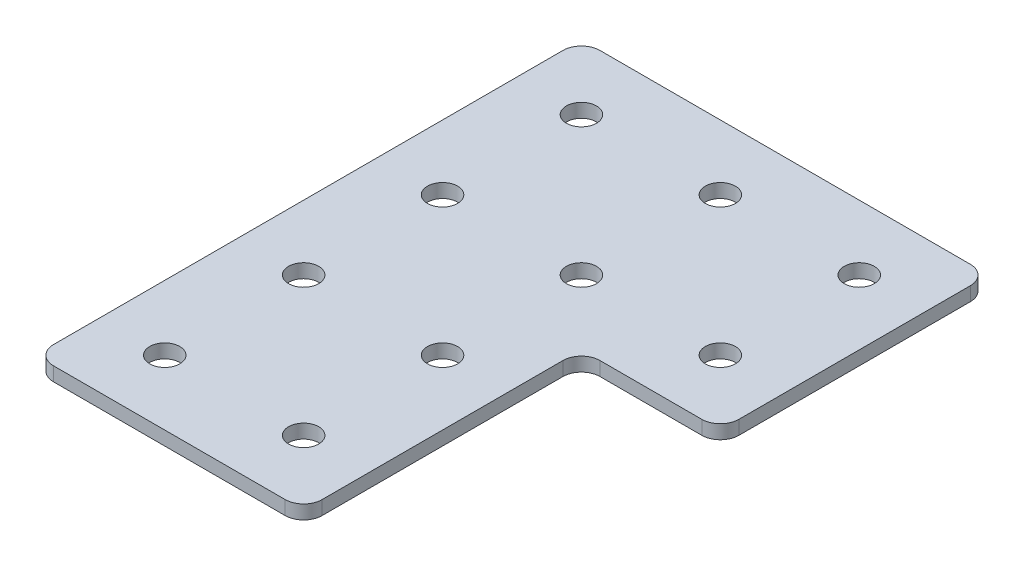
ISO-10303-21;
HEADER;
FILE_DESCRIPTION(('STEP AP214'),'2;1');
FILE_NAME('part.step','',(''),(''),'','','');
FILE_SCHEMA(('AUTOMOTIVE_DESIGN { 1 0 10303 214 1 1 1 1 }'));
ENDSEC;
DATA;
#1=APPLICATION_CONTEXT('core data for automotive mechanical design processes');
#2=APPLICATION_PROTOCOL_DEFINITION('international standard','automotive_design',2000,#1);
#3=PRODUCT_CONTEXT('',#1,'mechanical');
#4=PRODUCT('Part','Part','',(#3));
#5=PRODUCT_RELATED_PRODUCT_CATEGORY('part','',(#4));
#6=PRODUCT_DEFINITION_FORMATION('','',#4);
#7=PRODUCT_DEFINITION_CONTEXT('part definition',#1,'design');
#8=PRODUCT_DEFINITION('design','',#6,#7);
#9=PRODUCT_DEFINITION_SHAPE('','',#8);
#10=(LENGTH_UNIT() NAMED_UNIT(*) SI_UNIT(.MILLI.,.METRE.));
#11=(NAMED_UNIT(*) PLANE_ANGLE_UNIT() SI_UNIT($,.RADIAN.));
#12=(NAMED_UNIT(*) SI_UNIT($,.STERADIAN.) SOLID_ANGLE_UNIT());
#13=UNCERTAINTY_MEASURE_WITH_UNIT(LENGTH_MEASURE(1.E-05),#10,'distance_accuracy_value','');
#14=(GEOMETRIC_REPRESENTATION_CONTEXT(3) GLOBAL_UNCERTAINTY_ASSIGNED_CONTEXT((#13)) GLOBAL_UNIT_ASSIGNED_CONTEXT((#10,
#11,#12)) REPRESENTATION_CONTEXT('',''));
#15=CARTESIAN_POINT('',(0.,0.,0.));
#16=DIRECTION('',(0.,0.,1.));
#17=DIRECTION('',(1.,0.,0.));
#18=AXIS2_PLACEMENT_3D('',#15,#16,#17);
#19=CARTESIAN_POINT('',(-8.84521083117534,1.74134831028641,-16.1457325979904));
#20=DIRECTION('',(0.,-1.,0.));
#21=DIRECTION('',(0.,0.,-1.));
#22=AXIS2_PLACEMENT_3D('',#19,#20,#21);
#23=PLANE('',#22);
#24=CARTESIAN_POINT('',(13.6547891688246,1.74134831028641,-8.64573259799039));
#25=DIRECTION('',(0.,1.,0.));
#26=DIRECTION('',(0.,0.,1.));
#27=AXIS2_PLACEMENT_3D('',#24,#25,#26);
#28=CIRCLE('',#27,1.625);
#29=CARTESIAN_POINT('',(13.6547891688246,1.74134831028641,-7.02073259799039));
#30=VERTEX_POINT('',#29);
#31=EDGE_CURVE('E278',#30,#30,#28,.T.);
#32=ORIENTED_EDGE('',*,*,#31,.T.);
#33=EDGE_LOOP('',(#32));
#34=FACE_BOUND('',#33,.T.);
#35=CARTESIAN_POINT('',(-1.34521083117534,1.74134831028641,21.3542674020096));
#36=DIRECTION('',(0.,1.,0.));
#37=DIRECTION('',(0.,0.,1.));
#38=AXIS2_PLACEMENT_3D('',#35,#36,#37);
#39=CIRCLE('',#38,1.625);
#40=CARTESIAN_POINT('',(-1.34521083117534,1.74134831028641,22.9792674020096));
#41=VERTEX_POINT('',#40);
#42=EDGE_CURVE('E272',#41,#41,#39,.T.);
#43=ORIENTED_EDGE('',*,*,#42,.T.);
#44=EDGE_LOOP('',(#43));
#45=FACE_BOUND('',#44,.T.);
#46=CARTESIAN_POINT('',(-16.3452108311754,1.74134831028641,21.3542674020096));
#47=DIRECTION('',(0.,1.,0.));
#48=DIRECTION('',(0.,0.,1.));
#49=AXIS2_PLACEMENT_3D('',#46,#47,#48);
#50=CIRCLE('',#49,1.625);
#51=CARTESIAN_POINT('',(-16.3452108311754,1.74134831028641,22.9792674020096));
#52=VERTEX_POINT('',#51);
#53=EDGE_CURVE('E266',#52,#52,#50,.T.);
#54=ORIENTED_EDGE('',*,*,#53,.T.);
#55=EDGE_LOOP('',(#54));
#56=FACE_BOUND('',#55,.T.);
#57=CARTESIAN_POINT('',(-1.34521083117533,1.74134831028641,6.35426740200959));
#58=DIRECTION('',(0.,1.,0.));
#59=DIRECTION('',(0.,0.,1.));
#60=AXIS2_PLACEMENT_3D('',#57,#58,#59);
#61=CIRCLE('',#60,1.625);
#62=CARTESIAN_POINT('',(-1.34521083117533,1.74134831028641,7.97926740200959));
#63=VERTEX_POINT('',#62);
#64=EDGE_CURVE('E260',#63,#63,#61,.T.);
#65=ORIENTED_EDGE('',*,*,#64,.T.);
#66=EDGE_LOOP('',(#65));
#67=FACE_BOUND('',#66,.T.);
#68=CARTESIAN_POINT('',(-16.3452108311754,1.74134831028641,6.35426740200959));
#69=DIRECTION('',(0.,1.,0.));
#70=DIRECTION('',(0.,0.,1.));
#71=AXIS2_PLACEMENT_3D('',#68,#69,#70);
#72=CIRCLE('',#71,1.625);
#73=CARTESIAN_POINT('',(-16.3452108311754,1.74134831028641,7.97926740200959));
#74=VERTEX_POINT('',#73);
#75=EDGE_CURVE('E254',#74,#74,#72,.T.);
#76=ORIENTED_EDGE('',*,*,#75,.T.);
#77=EDGE_LOOP('',(#76));
#78=FACE_BOUND('',#77,.T.);
#79=CARTESIAN_POINT('',(-1.34521083117536,1.74134831028641,-8.6457325979904));
#80=DIRECTION('',(0.,1.,0.));
#81=DIRECTION('',(0.,0.,1.));
#82=AXIS2_PLACEMENT_3D('',#79,#80,#81);
#83=CIRCLE('',#82,1.625);
#84=CARTESIAN_POINT('',(-1.34521083117536,1.74134831028641,-7.02073259799039));
#85=VERTEX_POINT('',#84);
#86=EDGE_CURVE('E248',#85,#85,#83,.T.);
#87=ORIENTED_EDGE('',*,*,#86,.T.);
#88=EDGE_LOOP('',(#87));
#89=FACE_BOUND('',#88,.T.);
#90=CARTESIAN_POINT('',(-16.3452108311754,1.74134831028641,-8.64573259799041));
#91=DIRECTION('',(0.,1.,0.));
#92=DIRECTION('',(0.,0.,1.));
#93=AXIS2_PLACEMENT_3D('',#90,#91,#92);
#94=CIRCLE('',#93,1.625);
#95=CARTESIAN_POINT('',(-16.3452108311754,1.74134831028641,-7.02073259799041));
#96=VERTEX_POINT('',#95);
#97=EDGE_CURVE('E242',#96,#96,#94,.T.);
#98=ORIENTED_EDGE('',*,*,#97,.T.);
#99=EDGE_LOOP('',(#98));
#100=FACE_BOUND('',#99,.T.);
#101=CARTESIAN_POINT('',(13.6547891688246,1.74134831028641,-23.6457325979904));
#102=DIRECTION('',(0.,1.,0.));
#103=DIRECTION('',(0.,0.,1.));
#104=AXIS2_PLACEMENT_3D('',#101,#102,#103);
#105=CIRCLE('',#104,1.625);
#106=CARTESIAN_POINT('',(13.6547891688246,1.74134831028641,-22.0207325979904));
#107=VERTEX_POINT('',#106);
#108=EDGE_CURVE('E236',#107,#107,#105,.T.);
#109=ORIENTED_EDGE('',*,*,#108,.T.);
#110=EDGE_LOOP('',(#109));
#111=FACE_BOUND('',#110,.T.);
#112=CARTESIAN_POINT('',(-1.34521083117536,1.74134831028641,-23.6457325979904));
#113=DIRECTION('',(0.,1.,0.));
#114=DIRECTION('',(0.,0.,1.));
#115=AXIS2_PLACEMENT_3D('',#112,#113,#114);
#116=CIRCLE('',#115,1.625);
#117=CARTESIAN_POINT('',(-1.34521083117536,1.74134831028641,-22.0207325979904));
#118=VERTEX_POINT('',#117);
#119=EDGE_CURVE('E230',#118,#118,#116,.T.);
#120=ORIENTED_EDGE('',*,*,#119,.T.);
#121=EDGE_LOOP('',(#120));
#122=FACE_BOUND('',#121,.T.);
#123=CARTESIAN_POINT('',(-16.3452108311754,1.74134831028641,-23.6457325979904));
#124=DIRECTION('',(0.,1.,0.));
#125=DIRECTION('',(0.,0.,1.));
#126=AXIS2_PLACEMENT_3D('',#123,#124,#125);
#127=CIRCLE('',#126,1.625);
#128=CARTESIAN_POINT('',(-16.3452108311754,1.74134831028641,-22.0207325979904));
#129=VERTEX_POINT('',#128);
#130=EDGE_CURVE('E204',#129,#129,#127,.T.);
#131=ORIENTED_EDGE('',*,*,#130,.T.);
#132=EDGE_LOOP('',(#131));
#133=FACE_BOUND('',#132,.T.);
#134=DIRECTION('',(0.,0.,1.));
#135=VECTOR('',#134,1.);
#136=CARTESIAN_POINT('',(-23.3452108311753,1.74134831028641,-30.6457325979904));
#137=LINE('',#136,#135);
#138=CARTESIAN_POINT('',(-23.3452108311753,1.74134831028641,-28.6457325979904));
#139=VERTEX_POINT('',#138);
#140=CARTESIAN_POINT('',(-23.3452108311753,1.74134831028641,26.3542674020096));
#141=VERTEX_POINT('',#140);
#142=EDGE_CURVE('E200',#139,#141,#137,.T.);
#143=ORIENTED_EDGE('',*,*,#142,.F.);
#144=CARTESIAN_POINT('',(-21.3452108311753,1.74134831028641,-28.6457325979904));
#145=DIRECTION('',(0.,-1.,0.));
#146=DIRECTION('',(0.,0.,-1.));
#147=AXIS2_PLACEMENT_3D('',#144,#145,#146);
#148=CIRCLE('',#147,2.);
#149=CARTESIAN_POINT('',(-21.3452108311753,1.74134831028641,-30.6457325979904));
#150=VERTEX_POINT('',#149);
#151=EDGE_CURVE('E159',#139,#150,#148,.T.);
#152=ORIENTED_EDGE('',*,*,#151,.T.);
#153=DIRECTION('',(-1.,0.,0.));
#154=VECTOR('',#153,1.);
#155=CARTESIAN_POINT('',(20.6547891688247,1.74134831028641,-30.6457325979904));
#156=LINE('',#155,#154);
#157=CARTESIAN_POINT('',(18.6547891688247,1.74134831028641,-30.6457325979904));
#158=VERTEX_POINT('',#157);
#159=EDGE_CURVE('E222',#158,#150,#156,.T.);
#160=ORIENTED_EDGE('',*,*,#159,.F.);
#161=CARTESIAN_POINT('',(18.6547891688247,1.74134831028641,-28.6457325979904));
#162=DIRECTION('',(0.,-1.,0.));
#163=DIRECTION('',(0.,0.,-1.));
#164=AXIS2_PLACEMENT_3D('',#161,#162,#163);
#165=CIRCLE('',#164,2.);
#166=CARTESIAN_POINT('',(20.6547891688247,1.74134831028641,-28.6457325979904));
#167=VERTEX_POINT('',#166);
#168=EDGE_CURVE('E131',#158,#167,#165,.T.);
#169=ORIENTED_EDGE('',*,*,#168,.T.);
#170=DIRECTION('',(0.,0.,-1.));
#171=VECTOR('',#170,1.);
#172=CARTESIAN_POINT('',(20.6547891688247,1.74134831028641,-1.64573259799037));
#173=LINE('',#172,#171);
#174=CARTESIAN_POINT('',(20.6547891688247,1.74134831028641,-3.64573259799037));
#175=VERTEX_POINT('',#174);
#176=EDGE_CURVE('E190',#175,#167,#173,.T.);
#177=ORIENTED_EDGE('',*,*,#176,.F.);
#178=CARTESIAN_POINT('',(18.6547891688247,1.74134831028641,-3.64573259799037));
#179=DIRECTION('',(0.,-1.,0.));
#180=DIRECTION('',(0.,0.,-1.));
#181=AXIS2_PLACEMENT_3D('',#178,#179,#180);
#182=CIRCLE('',#181,2.);
#183=CARTESIAN_POINT('',(18.6547891688247,1.74134831028641,-1.64573259799037));
#184=VERTEX_POINT('',#183);
#185=EDGE_CURVE('E155',#175,#184,#182,.T.);
#186=ORIENTED_EDGE('',*,*,#185,.T.);
#187=DIRECTION('',(1.,0.,0.));
#188=VECTOR('',#187,1.);
#189=CARTESIAN_POINT('',(5.65478916882466,1.74134831028641,-1.64573259799037));
#190=LINE('',#189,#188);
#191=CARTESIAN_POINT('',(7.65478916882466,1.74134831028641,-1.64573259799037));
#192=VERTEX_POINT('',#191);
#193=EDGE_CURVE('E132',#192,#184,#190,.T.);
#194=ORIENTED_EDGE('',*,*,#193,.F.);
#195=CARTESIAN_POINT('',(7.65478916882466,1.74134831028641,0.354267402009629));
#196=DIRECTION('',(0.,-1.,0.));
#197=DIRECTION('',(0.,0.,-1.));
#198=AXIS2_PLACEMENT_3D('',#195,#196,#197);
#199=CIRCLE('',#198,2.);
#200=CARTESIAN_POINT('',(5.65478916882466,1.74134831028641,0.354267402009629));
#201=VERTEX_POINT('',#200);
#202=EDGE_CURVE('E10',#192,#201,#199,.F.);
#203=ORIENTED_EDGE('',*,*,#202,.T.);
#204=DIRECTION('',(0.,0.,-1.));
#205=VECTOR('',#204,1.);
#206=CARTESIAN_POINT('',(5.65478916882466,1.74134831028641,28.3542674020096));
#207=LINE('',#206,#205);
#208=CARTESIAN_POINT('',(5.65478916882466,1.74134831028641,26.3542674020096));
#209=VERTEX_POINT('',#208);
#210=EDGE_CURVE('E136',#209,#201,#207,.T.);
#211=ORIENTED_EDGE('',*,*,#210,.F.);
#212=CARTESIAN_POINT('',(3.65478916882466,1.74134831028641,26.3542674020096));
#213=DIRECTION('',(0.,-1.,0.));
#214=DIRECTION('',(0.,0.,-1.));
#215=AXIS2_PLACEMENT_3D('',#212,#213,#214);
#216=CIRCLE('',#215,2.);
#217=CARTESIAN_POINT('',(3.65478916882466,1.74134831028641,28.3542674020096));
#218=VERTEX_POINT('',#217);
#219=EDGE_CURVE('E31',#209,#218,#216,.T.);
#220=ORIENTED_EDGE('',*,*,#219,.T.);
#221=DIRECTION('',(1.,0.,0.));
#222=VECTOR('',#221,1.);
#223=CARTESIAN_POINT('',(-23.3452108311753,1.74134831028641,28.3542674020096));
#224=LINE('',#223,#222);
#225=CARTESIAN_POINT('',(-21.3452108311753,1.74134831028641,28.3542674020096));
#226=VERTEX_POINT('',#225);
#227=EDGE_CURVE('E198',#226,#218,#224,.T.);
#228=ORIENTED_EDGE('',*,*,#227,.F.);
#229=CARTESIAN_POINT('',(-21.3452108311753,1.74134831028641,26.3542674020096));
#230=DIRECTION('',(0.,-1.,0.));
#231=DIRECTION('',(0.,0.,-1.));
#232=AXIS2_PLACEMENT_3D('',#229,#230,#231);
#233=CIRCLE('',#232,2.);
#234=EDGE_CURVE('E157',#226,#141,#233,.T.);
#235=ORIENTED_EDGE('',*,*,#234,.T.);
#236=EDGE_LOOP('',(#143,#152,#160,#169,#177,#186,#194,#203,#211,#220,#228,#235));
#237=FACE_BOUND('',#236,.T.);
#238=ADVANCED_FACE('F16',(#34,#45,#56,#67,#78,#89,#100,#111,#122,#133,#237),#23,.T.);
#239=CARTESIAN_POINT('',(20.6547891688247,1.74134831028641,-1.64573259799037));
#240=DIRECTION('',(1.,0.,0.));
#241=DIRECTION('',(0.,0.,-1.));
#242=AXIS2_PLACEMENT_3D('',#239,#240,#241);
#243=PLANE('',#242);
#244=DIRECTION('',(0.,0.,-1.));
#245=VECTOR('',#244,1.);
#246=CARTESIAN_POINT('',(20.6547891688247,3.24134831028641,-1.64573259799037));
#247=LINE('',#246,#245);
#248=CARTESIAN_POINT('',(20.6547891688247,3.24134831028641,-3.64573259799037));
#249=VERTEX_POINT('',#248);
#250=CARTESIAN_POINT('',(20.6547891688247,3.24134831028641,-28.6457325979904));
#251=VERTEX_POINT('',#250);
#252=EDGE_CURVE('E111',#249,#251,#247,.T.);
#253=ORIENTED_EDGE('',*,*,#252,.F.);
#254=DIRECTION('',(0.,1.,0.));
#255=VECTOR('',#254,1.);
#256=CARTESIAN_POINT('',(20.6547891688247,1.74134831028641,-3.64573259799037));
#257=LINE('',#256,#255);
#258=EDGE_CURVE('E177',#249,#175,#257,.F.);
#259=ORIENTED_EDGE('',*,*,#258,.T.);
#260=ORIENTED_EDGE('',*,*,#176,.T.);
#261=DIRECTION('',(0.,1.,0.));
#262=VECTOR('',#261,1.);
#263=CARTESIAN_POINT('',(20.6547891688247,1.74134831028641,-28.6457325979904));
#264=LINE('',#263,#262);
#265=EDGE_CURVE('E175',#167,#251,#264,.T.);
#266=ORIENTED_EDGE('',*,*,#265,.T.);
#267=EDGE_LOOP('',(#253,#259,#260,#266));
#268=FACE_BOUND('',#267,.T.);
#269=ADVANCED_FACE('F333',(#268),#243,.T.);
#270=CARTESIAN_POINT('',(5.65478916882466,1.74134831028641,-1.64573259799037));
#271=DIRECTION('',(0.,0.,1.));
#272=DIRECTION('',(1.,0.,0.));
#273=AXIS2_PLACEMENT_3D('',#270,#271,#272);
#274=PLANE('',#273);
#275=DIRECTION('',(1.,0.,0.));
#276=VECTOR('',#275,1.);
#277=CARTESIAN_POINT('',(5.65478916882466,3.24134831028641,-1.64573259799037));
#278=LINE('',#277,#276);
#279=CARTESIAN_POINT('',(7.65478916882466,3.24134831028641,-1.64573259799037));
#280=VERTEX_POINT('',#279);
#281=CARTESIAN_POINT('',(18.6547891688247,3.24134831028641,-1.64573259799037));
#282=VERTEX_POINT('',#281);
#283=EDGE_CURVE('E139',#280,#282,#278,.T.);
#284=ORIENTED_EDGE('',*,*,#283,.F.);
#285=DIRECTION('',(0.,1.,0.));
#286=VECTOR('',#285,1.);
#287=CARTESIAN_POINT('',(7.65478916882466,1.74134831028641,-1.64573259799037));
#288=LINE('',#287,#286);
#289=EDGE_CURVE('E173',#280,#192,#288,.F.);
#290=ORIENTED_EDGE('',*,*,#289,.T.);
#291=ORIENTED_EDGE('',*,*,#193,.T.);
#292=DIRECTION('',(0.,1.,0.));
#293=VECTOR('',#292,1.);
#294=CARTESIAN_POINT('',(18.6547891688247,1.74134831028641,-1.64573259799037));
#295=LINE('',#294,#293);
#296=EDGE_CURVE('E170',#184,#282,#295,.T.);
#297=ORIENTED_EDGE('',*,*,#296,.T.);
#298=EDGE_LOOP('',(#284,#290,#291,#297));
#299=FACE_BOUND('',#298,.T.);
#300=ADVANCED_FACE('F187',(#299),#274,.T.);
#301=CARTESIAN_POINT('',(5.65478916882466,1.74134831028641,28.3542674020096));
#302=DIRECTION('',(1.,0.,0.));
#303=DIRECTION('',(0.,0.,-1.));
#304=AXIS2_PLACEMENT_3D('',#301,#302,#303);
#305=PLANE('',#304);
#306=ORIENTED_EDGE('',*,*,#210,.T.);
#307=DIRECTION('',(0.,1.,0.));
#308=VECTOR('',#307,1.);
#309=CARTESIAN_POINT('',(5.65478916882466,3.24134831028641,0.354267402009629));
#310=LINE('',#309,#308);
#311=CARTESIAN_POINT('',(5.65478916882466,3.24134831028641,0.354267402009629));
#312=VERTEX_POINT('',#311);
#313=EDGE_CURVE('E167',#201,#312,#310,.T.);
#314=ORIENTED_EDGE('',*,*,#313,.T.);
#315=DIRECTION('',(0.,0.,-1.));
#316=VECTOR('',#315,1.);
#317=CARTESIAN_POINT('',(5.65478916882466,3.24134831028641,28.3542674020096));
#318=LINE('',#317,#316);
#319=CARTESIAN_POINT('',(5.65478916882466,3.24134831028641,26.3542674020096));
#320=VERTEX_POINT('',#319);
#321=EDGE_CURVE('E182',#320,#312,#318,.T.);
#322=ORIENTED_EDGE('',*,*,#321,.F.);
#323=DIRECTION('',(0.,1.,0.));
#324=VECTOR('',#323,1.);
#325=CARTESIAN_POINT('',(5.65478916882466,1.74134831028641,26.3542674020096));
#326=LINE('',#325,#324);
#327=EDGE_CURVE('E165',#320,#209,#326,.F.);
#328=ORIENTED_EDGE('',*,*,#327,.T.);
#329=EDGE_LOOP('',(#306,#314,#322,#328));
#330=FACE_BOUND('',#329,.T.);
#331=ADVANCED_FACE('F196',(#330),#305,.T.);
#332=CARTESIAN_POINT('',(-23.3452108311753,1.74134831028641,28.3542674020096));
#333=DIRECTION('',(0.,0.,1.));
#334=DIRECTION('',(1.,0.,0.));
#335=AXIS2_PLACEMENT_3D('',#332,#333,#334);
#336=PLANE('',#335);
#337=DIRECTION('',(1.,0.,0.));
#338=VECTOR('',#337,1.);
#339=CARTESIAN_POINT('',(-23.3452108311753,3.24134831028641,28.3542674020096));
#340=LINE('',#339,#338);
#341=CARTESIAN_POINT('',(-21.3452108311753,3.24134831028641,28.3542674020096));
#342=VERTEX_POINT('',#341);
#343=CARTESIAN_POINT('',(3.65478916882466,3.24134831028641,28.3542674020096));
#344=VERTEX_POINT('',#343);
#345=EDGE_CURVE('E208',#342,#344,#340,.T.);
#346=ORIENTED_EDGE('',*,*,#345,.F.);
#347=DIRECTION('',(0.,1.,0.));
#348=VECTOR('',#347,1.);
#349=CARTESIAN_POINT('',(-21.3452108311753,1.74134831028641,28.3542674020096));
#350=LINE('',#349,#348);
#351=EDGE_CURVE('E38',#342,#226,#350,.F.);
#352=ORIENTED_EDGE('',*,*,#351,.T.);
#353=ORIENTED_EDGE('',*,*,#227,.T.);
#354=DIRECTION('',(0.,1.,0.));
#355=VECTOR('',#354,1.);
#356=CARTESIAN_POINT('',(3.65478916882466,1.74134831028641,28.3542674020096));
#357=LINE('',#356,#355);
#358=EDGE_CURVE('E161',#218,#344,#357,.T.);
#359=ORIENTED_EDGE('',*,*,#358,.T.);
#360=EDGE_LOOP('',(#346,#352,#353,#359));
#361=FACE_BOUND('',#360,.T.);
#362=ADVANCED_FACE('F210',(#361),#336,.T.);
#363=CARTESIAN_POINT('',(-23.3452108311753,1.74134831028641,-30.6457325979904));
#364=DIRECTION('',(-1.,0.,0.));
#365=DIRECTION('',(0.,0.,1.));
#366=AXIS2_PLACEMENT_3D('',#363,#364,#365);
#367=PLANE('',#366);
#368=DIRECTION('',(0.,0.,1.));
#369=VECTOR('',#368,1.);
#370=CARTESIAN_POINT('',(-23.3452108311753,3.24134831028641,-30.6457325979904));
#371=LINE('',#370,#369);
#372=CARTESIAN_POINT('',(-23.3452108311753,3.24134831028641,-28.6457325979904));
#373=VERTEX_POINT('',#372);
#374=CARTESIAN_POINT('',(-23.3452108311753,3.24134831028641,26.3542674020096));
#375=VERTEX_POINT('',#374);
#376=EDGE_CURVE('E127',#373,#375,#371,.T.);
#377=ORIENTED_EDGE('',*,*,#376,.F.);
#378=DIRECTION('',(0.,1.,0.));
#379=VECTOR('',#378,1.);
#380=CARTESIAN_POINT('',(-23.3452108311753,1.74134831028641,-28.6457325979904));
#381=LINE('',#380,#379);
#382=EDGE_CURVE('E151',#373,#139,#381,.F.);
#383=ORIENTED_EDGE('',*,*,#382,.T.);
#384=ORIENTED_EDGE('',*,*,#142,.T.);
#385=DIRECTION('',(0.,1.,0.));
#386=VECTOR('',#385,1.);
#387=CARTESIAN_POINT('',(-23.3452108311753,1.74134831028641,26.3542674020096));
#388=LINE('',#387,#386);
#389=EDGE_CURVE('E148',#141,#375,#388,.T.);
#390=ORIENTED_EDGE('',*,*,#389,.T.);
#391=EDGE_LOOP('',(#377,#383,#384,#390));
#392=FACE_BOUND('',#391,.T.);
#393=ADVANCED_FACE('F220',(#392),#367,.T.);
#394=CARTESIAN_POINT('',(20.6547891688247,1.74134831028641,-30.6457325979904));
#395=DIRECTION('',(0.,0.,-1.));
#396=DIRECTION('',(-1.,0.,0.));
#397=AXIS2_PLACEMENT_3D('',#394,#395,#396);
#398=PLANE('',#397);
#399=ORIENTED_EDGE('',*,*,#159,.T.);
#400=DIRECTION('',(0.,1.,0.));
#401=VECTOR('',#400,1.);
#402=CARTESIAN_POINT('',(-21.3452108311753,1.74134831028641,-30.6457325979904));
#403=LINE('',#402,#401);
#404=CARTESIAN_POINT('',(-21.3452108311753,3.24134831028641,-30.6457325979904));
#405=VERTEX_POINT('',#404);
#406=EDGE_CURVE('E126',#150,#405,#403,.T.);
#407=ORIENTED_EDGE('',*,*,#406,.T.);
#408=DIRECTION('',(-1.,0.,0.));
#409=VECTOR('',#408,1.);
#410=CARTESIAN_POINT('',(20.6547891688247,3.24134831028641,-30.6457325979904));
#411=LINE('',#410,#409);
#412=CARTESIAN_POINT('',(18.6547891688247,3.24134831028641,-30.6457325979904));
#413=VERTEX_POINT('',#412);
#414=EDGE_CURVE('E109',#413,#405,#411,.T.);
#415=ORIENTED_EDGE('',*,*,#414,.F.);
#416=DIRECTION('',(0.,1.,0.));
#417=VECTOR('',#416,1.);
#418=CARTESIAN_POINT('',(18.6547891688247,1.74134831028641,-30.6457325979904));
#419=LINE('',#418,#417);
#420=EDGE_CURVE('E123',#413,#158,#419,.F.);
#421=ORIENTED_EDGE('',*,*,#420,.T.);
#422=EDGE_LOOP('',(#399,#407,#415,#421));
#423=FACE_BOUND('',#422,.T.);
#424=ADVANCED_FACE('F122',(#423),#398,.T.);
#425=CARTESIAN_POINT('',(-8.84521083117534,3.24134831028641,-16.1457325979904));
#426=DIRECTION('',(0.,-1.,0.));
#427=DIRECTION('',(0.,0.,-1.));
#428=AXIS2_PLACEMENT_3D('',#425,#426,#427);
#429=PLANE('',#428);
#430=CARTESIAN_POINT('',(13.6547891688246,3.24134831028641,-8.64573259799039));
#431=DIRECTION('',(0.,1.,0.));
#432=DIRECTION('',(0.,0.,1.));
#433=AXIS2_PLACEMENT_3D('',#430,#431,#432);
#434=CIRCLE('',#433,1.625);
#435=CARTESIAN_POINT('',(13.6547891688246,3.24134831028641,-7.02073259799039));
#436=VERTEX_POINT('',#435);
#437=EDGE_CURVE('E281',#436,#436,#434,.T.);
#438=ORIENTED_EDGE('',*,*,#437,.F.);
#439=EDGE_LOOP('',(#438));
#440=FACE_BOUND('',#439,.T.);
#441=CARTESIAN_POINT('',(-1.34521083117534,3.24134831028641,21.3542674020096));
#442=DIRECTION('',(0.,1.,0.));
#443=DIRECTION('',(0.,0.,1.));
#444=AXIS2_PLACEMENT_3D('',#441,#442,#443);
#445=CIRCLE('',#444,1.625);
#446=CARTESIAN_POINT('',(-1.34521083117534,3.24134831028641,22.9792674020096));
#447=VERTEX_POINT('',#446);
#448=EDGE_CURVE('E275',#447,#447,#445,.T.);
#449=ORIENTED_EDGE('',*,*,#448,.F.);
#450=EDGE_LOOP('',(#449));
#451=FACE_BOUND('',#450,.T.);
#452=CARTESIAN_POINT('',(-16.3452108311754,3.24134831028641,21.3542674020096));
#453=DIRECTION('',(0.,1.,0.));
#454=DIRECTION('',(0.,0.,1.));
#455=AXIS2_PLACEMENT_3D('',#452,#453,#454);
#456=CIRCLE('',#455,1.625);
#457=CARTESIAN_POINT('',(-16.3452108311754,3.24134831028641,22.9792674020096));
#458=VERTEX_POINT('',#457);
#459=EDGE_CURVE('E269',#458,#458,#456,.T.);
#460=ORIENTED_EDGE('',*,*,#459,.F.);
#461=EDGE_LOOP('',(#460));
#462=FACE_BOUND('',#461,.T.);
#463=CARTESIAN_POINT('',(-1.34521083117533,3.24134831028641,6.35426740200959));
#464=DIRECTION('',(0.,1.,0.));
#465=DIRECTION('',(0.,0.,1.));
#466=AXIS2_PLACEMENT_3D('',#463,#464,#465);
#467=CIRCLE('',#466,1.625);
#468=CARTESIAN_POINT('',(-1.34521083117533,3.24134831028641,7.97926740200959));
#469=VERTEX_POINT('',#468);
#470=EDGE_CURVE('E263',#469,#469,#467,.T.);
#471=ORIENTED_EDGE('',*,*,#470,.F.);
#472=EDGE_LOOP('',(#471));
#473=FACE_BOUND('',#472,.T.);
#474=CARTESIAN_POINT('',(-16.3452108311754,3.24134831028641,6.35426740200959));
#475=DIRECTION('',(0.,1.,0.));
#476=DIRECTION('',(0.,0.,1.));
#477=AXIS2_PLACEMENT_3D('',#474,#475,#476);
#478=CIRCLE('',#477,1.625);
#479=CARTESIAN_POINT('',(-16.3452108311754,3.24134831028641,7.97926740200959));
#480=VERTEX_POINT('',#479);
#481=EDGE_CURVE('E257',#480,#480,#478,.T.);
#482=ORIENTED_EDGE('',*,*,#481,.F.);
#483=EDGE_LOOP('',(#482));
#484=FACE_BOUND('',#483,.T.);
#485=CARTESIAN_POINT('',(-1.34521083117536,3.24134831028641,-8.6457325979904));
#486=DIRECTION('',(0.,1.,0.));
#487=DIRECTION('',(0.,0.,1.));
#488=AXIS2_PLACEMENT_3D('',#485,#486,#487);
#489=CIRCLE('',#488,1.625);
#490=CARTESIAN_POINT('',(-1.34521083117536,3.24134831028641,-7.02073259799039));
#491=VERTEX_POINT('',#490);
#492=EDGE_CURVE('E251',#491,#491,#489,.T.);
#493=ORIENTED_EDGE('',*,*,#492,.F.);
#494=EDGE_LOOP('',(#493));
#495=FACE_BOUND('',#494,.T.);
#496=CARTESIAN_POINT('',(-16.3452108311754,3.24134831028641,-8.64573259799041));
#497=DIRECTION('',(0.,1.,0.));
#498=DIRECTION('',(0.,0.,1.));
#499=AXIS2_PLACEMENT_3D('',#496,#497,#498);
#500=CIRCLE('',#499,1.625);
#501=CARTESIAN_POINT('',(-16.3452108311754,3.24134831028641,-7.02073259799041));
#502=VERTEX_POINT('',#501);
#503=EDGE_CURVE('E245',#502,#502,#500,.T.);
#504=ORIENTED_EDGE('',*,*,#503,.F.);
#505=EDGE_LOOP('',(#504));
#506=FACE_BOUND('',#505,.T.);
#507=CARTESIAN_POINT('',(13.6547891688246,3.24134831028641,-23.6457325979904));
#508=DIRECTION('',(0.,1.,0.));
#509=DIRECTION('',(0.,0.,1.));
#510=AXIS2_PLACEMENT_3D('',#507,#508,#509);
#511=CIRCLE('',#510,1.625);
#512=CARTESIAN_POINT('',(13.6547891688246,3.24134831028641,-22.0207325979904));
#513=VERTEX_POINT('',#512);
#514=EDGE_CURVE('E239',#513,#513,#511,.T.);
#515=ORIENTED_EDGE('',*,*,#514,.F.);
#516=EDGE_LOOP('',(#515));
#517=FACE_BOUND('',#516,.T.);
#518=CARTESIAN_POINT('',(-1.34521083117536,3.24134831028641,-23.6457325979904));
#519=DIRECTION('',(0.,1.,0.));
#520=DIRECTION('',(0.,0.,1.));
#521=AXIS2_PLACEMENT_3D('',#518,#519,#520);
#522=CIRCLE('',#521,1.625);
#523=CARTESIAN_POINT('',(-1.34521083117536,3.24134831028641,-22.0207325979904));
#524=VERTEX_POINT('',#523);
#525=EDGE_CURVE('E233',#524,#524,#522,.T.);
#526=ORIENTED_EDGE('',*,*,#525,.F.);
#527=EDGE_LOOP('',(#526));
#528=FACE_BOUND('',#527,.T.);
#529=CARTESIAN_POINT('',(-16.3452108311754,3.24134831028641,-23.6457325979904));
#530=DIRECTION('',(0.,1.,0.));
#531=DIRECTION('',(0.,0.,1.));
#532=AXIS2_PLACEMENT_3D('',#529,#530,#531);
#533=CIRCLE('',#532,1.625);
#534=CARTESIAN_POINT('',(-16.3452108311754,3.24134831028641,-22.0207325979904));
#535=VERTEX_POINT('',#534);
#536=EDGE_CURVE('E227',#535,#535,#533,.T.);
#537=ORIENTED_EDGE('',*,*,#536,.F.);
#538=EDGE_LOOP('',(#537));
#539=FACE_BOUND('',#538,.T.);
#540=ORIENTED_EDGE('',*,*,#414,.T.);
#541=CARTESIAN_POINT('',(-21.3452108311753,3.24134831028641,-28.6457325979904));
#542=DIRECTION('',(0.,-1.,0.));
#543=DIRECTION('',(0.,0.,-1.));
#544=AXIS2_PLACEMENT_3D('',#541,#542,#543);
#545=CIRCLE('',#544,2.);
#546=EDGE_CURVE('E146',#405,#373,#545,.F.);
#547=ORIENTED_EDGE('',*,*,#546,.T.);
#548=ORIENTED_EDGE('',*,*,#376,.T.);
#549=CARTESIAN_POINT('',(-21.3452108311753,3.24134831028641,26.3542674020096));
#550=DIRECTION('',(0.,-1.,0.));
#551=DIRECTION('',(0.,0.,-1.));
#552=AXIS2_PLACEMENT_3D('',#549,#550,#551);
#553=CIRCLE('',#552,2.);
#554=EDGE_CURVE('E144',#375,#342,#553,.F.);
#555=ORIENTED_EDGE('',*,*,#554,.T.);
#556=ORIENTED_EDGE('',*,*,#345,.T.);
#557=CARTESIAN_POINT('',(3.65478916882466,3.24134831028641,26.3542674020096));
#558=DIRECTION('',(0.,-1.,0.));
#559=DIRECTION('',(0.,0.,-1.));
#560=AXIS2_PLACEMENT_3D('',#557,#558,#559);
#561=CIRCLE('',#560,2.);
#562=EDGE_CURVE('E117',#344,#320,#561,.F.);
#563=ORIENTED_EDGE('',*,*,#562,.T.);
#564=ORIENTED_EDGE('',*,*,#321,.T.);
#565=CARTESIAN_POINT('',(7.65478916882466,3.24134831028641,0.354267402009629));
#566=DIRECTION('',(0.,-1.,0.));
#567=DIRECTION('',(0.,0.,-1.));
#568=AXIS2_PLACEMENT_3D('',#565,#566,#567);
#569=CIRCLE('',#568,2.);
#570=EDGE_CURVE('E24',#312,#280,#569,.T.);
#571=ORIENTED_EDGE('',*,*,#570,.T.);
#572=ORIENTED_EDGE('',*,*,#283,.T.);
#573=CARTESIAN_POINT('',(18.6547891688247,3.24134831028641,-3.64573259799037));
#574=DIRECTION('',(0.,-1.,0.));
#575=DIRECTION('',(0.,0.,-1.));
#576=AXIS2_PLACEMENT_3D('',#573,#574,#575);
#577=CIRCLE('',#576,2.);
#578=EDGE_CURVE('E116',#282,#249,#577,.F.);
#579=ORIENTED_EDGE('',*,*,#578,.T.);
#580=ORIENTED_EDGE('',*,*,#252,.T.);
#581=CARTESIAN_POINT('',(18.6547891688247,3.24134831028641,-28.6457325979904));
#582=DIRECTION('',(0.,-1.,0.));
#583=DIRECTION('',(0.,0.,-1.));
#584=AXIS2_PLACEMENT_3D('',#581,#582,#583);
#585=CIRCLE('',#584,2.);
#586=EDGE_CURVE('E106',#251,#413,#585,.F.);
#587=ORIENTED_EDGE('',*,*,#586,.T.);
#588=EDGE_LOOP('',(#540,#547,#548,#555,#556,#563,#564,#571,#572,#579,#580,#587));
#589=FACE_BOUND('',#588,.T.);
#590=ADVANCED_FACE('F108',(#440,#451,#462,#473,#484,#495,#506,#517,#528,#539,#589),#429,.F.);
#591=CARTESIAN_POINT('',(-16.3452108311754,1.74134831028641,-23.6457325979904));
#592=DIRECTION('',(0.,1.,0.));
#593=DIRECTION('',(0.,0.,1.));
#594=AXIS2_PLACEMENT_3D('',#591,#592,#593);
#595=CYLINDRICAL_SURFACE('',#594,1.625);
#596=ORIENTED_EDGE('',*,*,#130,.F.);
#597=EDGE_LOOP('',(#596));
#598=FACE_BOUND('',#597,.T.);
#599=ORIENTED_EDGE('',*,*,#536,.T.);
#600=EDGE_LOOP('',(#599));
#601=FACE_BOUND('',#600,.T.);
#602=ADVANCED_FACE('F299',(#598,#601),#595,.F.);
#603=CARTESIAN_POINT('',(-1.34521083117536,1.74134831028641,-23.6457325979904));
#604=DIRECTION('',(0.,1.,0.));
#605=DIRECTION('',(0.,0.,1.));
#606=AXIS2_PLACEMENT_3D('',#603,#604,#605);
#607=CYLINDRICAL_SURFACE('',#606,1.625);
#608=ORIENTED_EDGE('',*,*,#119,.F.);
#609=EDGE_LOOP('',(#608));
#610=FACE_BOUND('',#609,.T.);
#611=ORIENTED_EDGE('',*,*,#525,.T.);
#612=EDGE_LOOP('',(#611));
#613=FACE_BOUND('',#612,.T.);
#614=ADVANCED_FACE('F320',(#610,#613),#607,.F.);
#615=CARTESIAN_POINT('',(13.6547891688246,1.74134831028641,-23.6457325979904));
#616=DIRECTION('',(0.,1.,0.));
#617=DIRECTION('',(0.,0.,1.));
#618=AXIS2_PLACEMENT_3D('',#615,#616,#617);
#619=CYLINDRICAL_SURFACE('',#618,1.625);
#620=ORIENTED_EDGE('',*,*,#108,.F.);
#621=EDGE_LOOP('',(#620));
#622=FACE_BOUND('',#621,.T.);
#623=ORIENTED_EDGE('',*,*,#514,.T.);
#624=EDGE_LOOP('',(#623));
#625=FACE_BOUND('',#624,.T.);
#626=ADVANCED_FACE('F327',(#622,#625),#619,.F.);
#627=CARTESIAN_POINT('',(-16.3452108311754,1.74134831028641,-8.64573259799041));
#628=DIRECTION('',(0.,1.,0.));
#629=DIRECTION('',(0.,0.,1.));
#630=AXIS2_PLACEMENT_3D('',#627,#628,#629);
#631=CYLINDRICAL_SURFACE('',#630,1.625);
#632=ORIENTED_EDGE('',*,*,#97,.F.);
#633=EDGE_LOOP('',(#632));
#634=FACE_BOUND('',#633,.T.);
#635=ORIENTED_EDGE('',*,*,#503,.T.);
#636=EDGE_LOOP('',(#635));
#637=FACE_BOUND('',#636,.T.);
#638=ADVANCED_FACE('F446',(#634,#637),#631,.F.);
#639=CARTESIAN_POINT('',(-1.34521083117536,1.74134831028641,-8.6457325979904));
#640=DIRECTION('',(0.,1.,0.));
#641=DIRECTION('',(0.,0.,1.));
#642=AXIS2_PLACEMENT_3D('',#639,#640,#641);
#643=CYLINDRICAL_SURFACE('',#642,1.625);
#644=ORIENTED_EDGE('',*,*,#86,.F.);
#645=EDGE_LOOP('',(#644));
#646=FACE_BOUND('',#645,.T.);
#647=ORIENTED_EDGE('',*,*,#492,.T.);
#648=EDGE_LOOP('',(#647));
#649=FACE_BOUND('',#648,.T.);
#650=ADVANCED_FACE('F436',(#646,#649),#643,.F.);
#651=CARTESIAN_POINT('',(-16.3452108311754,1.74134831028641,6.35426740200959));
#652=DIRECTION('',(0.,1.,0.));
#653=DIRECTION('',(0.,0.,1.));
#654=AXIS2_PLACEMENT_3D('',#651,#652,#653);
#655=CYLINDRICAL_SURFACE('',#654,1.625);
#656=ORIENTED_EDGE('',*,*,#75,.F.);
#657=EDGE_LOOP('',(#656));
#658=FACE_BOUND('',#657,.T.);
#659=ORIENTED_EDGE('',*,*,#481,.T.);
#660=EDGE_LOOP('',(#659));
#661=FACE_BOUND('',#660,.T.);
#662=ADVANCED_FACE('F426',(#658,#661),#655,.F.);
#663=CARTESIAN_POINT('',(-1.34521083117533,1.74134831028641,6.35426740200959));
#664=DIRECTION('',(0.,1.,0.));
#665=DIRECTION('',(0.,0.,1.));
#666=AXIS2_PLACEMENT_3D('',#663,#664,#665);
#667=CYLINDRICAL_SURFACE('',#666,1.625);
#668=ORIENTED_EDGE('',*,*,#64,.F.);
#669=EDGE_LOOP('',(#668));
#670=FACE_BOUND('',#669,.T.);
#671=ORIENTED_EDGE('',*,*,#470,.T.);
#672=EDGE_LOOP('',(#671));
#673=FACE_BOUND('',#672,.T.);
#674=ADVANCED_FACE('F416',(#670,#673),#667,.F.);
#675=CARTESIAN_POINT('',(-16.3452108311754,1.74134831028641,21.3542674020096));
#676=DIRECTION('',(0.,1.,0.));
#677=DIRECTION('',(0.,0.,1.));
#678=AXIS2_PLACEMENT_3D('',#675,#676,#677);
#679=CYLINDRICAL_SURFACE('',#678,1.625);
#680=ORIENTED_EDGE('',*,*,#53,.F.);
#681=EDGE_LOOP('',(#680));
#682=FACE_BOUND('',#681,.T.);
#683=ORIENTED_EDGE('',*,*,#459,.T.);
#684=EDGE_LOOP('',(#683));
#685=FACE_BOUND('',#684,.T.);
#686=ADVANCED_FACE('F406',(#682,#685),#679,.F.);
#687=CARTESIAN_POINT('',(-1.34521083117534,1.74134831028641,21.3542674020096));
#688=DIRECTION('',(0.,1.,0.));
#689=DIRECTION('',(0.,0.,1.));
#690=AXIS2_PLACEMENT_3D('',#687,#688,#689);
#691=CYLINDRICAL_SURFACE('',#690,1.625);
#692=ORIENTED_EDGE('',*,*,#42,.F.);
#693=EDGE_LOOP('',(#692));
#694=FACE_BOUND('',#693,.T.);
#695=ORIENTED_EDGE('',*,*,#448,.T.);
#696=EDGE_LOOP('',(#695));
#697=FACE_BOUND('',#696,.T.);
#698=ADVANCED_FACE('F293',(#694,#697),#691,.F.);
#699=CARTESIAN_POINT('',(13.6547891688246,1.74134831028641,-8.64573259799039));
#700=DIRECTION('',(0.,1.,0.));
#701=DIRECTION('',(0.,0.,1.));
#702=AXIS2_PLACEMENT_3D('',#699,#700,#701);
#703=CYLINDRICAL_SURFACE('',#702,1.625);
#704=ORIENTED_EDGE('',*,*,#31,.F.);
#705=EDGE_LOOP('',(#704));
#706=FACE_BOUND('',#705,.T.);
#707=ORIENTED_EDGE('',*,*,#437,.T.);
#708=EDGE_LOOP('',(#707));
#709=FACE_BOUND('',#708,.T.);
#710=ADVANCED_FACE('F289',(#706,#709),#703,.F.);
#711=CARTESIAN_POINT('',(-21.3452108311753,1.74134831028641,-28.6457325979904));
#712=DIRECTION('',(0.,1.,0.));
#713=DIRECTION('',(0.,0.,1.));
#714=AXIS2_PLACEMENT_3D('',#711,#712,#713);
#715=CYLINDRICAL_SURFACE('',#714,2.);
#716=ORIENTED_EDGE('',*,*,#151,.F.);
#717=ORIENTED_EDGE('',*,*,#382,.F.);
#718=ORIENTED_EDGE('',*,*,#546,.F.);
#719=ORIENTED_EDGE('',*,*,#406,.F.);
#720=EDGE_LOOP('',(#716,#717,#718,#719));
#721=FACE_BOUND('',#720,.T.);
#722=ADVANCED_FACE('F292',(#721),#715,.T.);
#723=CARTESIAN_POINT('',(-21.3452108311753,1.74134831028641,26.3542674020096));
#724=DIRECTION('',(0.,1.,0.));
#725=DIRECTION('',(0.,0.,1.));
#726=AXIS2_PLACEMENT_3D('',#723,#724,#725);
#727=CYLINDRICAL_SURFACE('',#726,2.);
#728=ORIENTED_EDGE('',*,*,#234,.F.);
#729=ORIENTED_EDGE('',*,*,#351,.F.);
#730=ORIENTED_EDGE('',*,*,#554,.F.);
#731=ORIENTED_EDGE('',*,*,#389,.F.);
#732=EDGE_LOOP('',(#728,#729,#730,#731));
#733=FACE_BOUND('',#732,.T.);
#734=ADVANCED_FACE('F214',(#733),#727,.T.);
#735=CARTESIAN_POINT('',(7.65478916882466,1.74134831028641,0.354267402009629));
#736=DIRECTION('',(0.,-1.,0.));
#737=DIRECTION('',(0.,0.,-1.));
#738=AXIS2_PLACEMENT_3D('',#735,#736,#737);
#739=CYLINDRICAL_SURFACE('',#738,2.);
#740=ORIENTED_EDGE('',*,*,#202,.F.);
#741=ORIENTED_EDGE('',*,*,#289,.F.);
#742=ORIENTED_EDGE('',*,*,#570,.F.);
#743=ORIENTED_EDGE('',*,*,#313,.F.);
#744=EDGE_LOOP('',(#740,#741,#742,#743));
#745=FACE_BOUND('',#744,.T.);
#746=ADVANCED_FACE('F192',(#745),#739,.F.);
#747=CARTESIAN_POINT('',(18.6547891688247,1.74134831028641,-3.64573259799037));
#748=DIRECTION('',(0.,1.,0.));
#749=DIRECTION('',(0.,0.,1.));
#750=AXIS2_PLACEMENT_3D('',#747,#748,#749);
#751=CYLINDRICAL_SURFACE('',#750,2.);
#752=ORIENTED_EDGE('',*,*,#185,.F.);
#753=ORIENTED_EDGE('',*,*,#258,.F.);
#754=ORIENTED_EDGE('',*,*,#578,.F.);
#755=ORIENTED_EDGE('',*,*,#296,.F.);
#756=EDGE_LOOP('',(#752,#753,#754,#755));
#757=FACE_BOUND('',#756,.T.);
#758=ADVANCED_FACE('F348',(#757),#751,.T.);
#759=CARTESIAN_POINT('',(18.6547891688247,1.74134831028641,-28.6457325979904));
#760=DIRECTION('',(0.,1.,0.));
#761=DIRECTION('',(0.,0.,1.));
#762=AXIS2_PLACEMENT_3D('',#759,#760,#761);
#763=CYLINDRICAL_SURFACE('',#762,2.);
#764=ORIENTED_EDGE('',*,*,#168,.F.);
#765=ORIENTED_EDGE('',*,*,#420,.F.);
#766=ORIENTED_EDGE('',*,*,#586,.F.);
#767=ORIENTED_EDGE('',*,*,#265,.F.);
#768=EDGE_LOOP('',(#764,#765,#766,#767));
#769=FACE_BOUND('',#768,.T.);
#770=ADVANCED_FACE('F130',(#769),#763,.T.);
#771=CARTESIAN_POINT('',(3.65478916882466,1.74134831028641,26.3542674020096));
#772=DIRECTION('',(0.,1.,0.));
#773=DIRECTION('',(0.,0.,1.));
#774=AXIS2_PLACEMENT_3D('',#771,#772,#773);
#775=CYLINDRICAL_SURFACE('',#774,2.);
#776=ORIENTED_EDGE('',*,*,#219,.F.);
#777=ORIENTED_EDGE('',*,*,#327,.F.);
#778=ORIENTED_EDGE('',*,*,#562,.F.);
#779=ORIENTED_EDGE('',*,*,#358,.F.);
#780=EDGE_LOOP('',(#776,#777,#778,#779));
#781=FACE_BOUND('',#780,.T.);
#782=ADVANCED_FACE('F18',(#781),#775,.T.);
#783=CLOSED_SHELL('',(#238,#269,#300,#331,#362,#393,#424,#590,#602,#614,#626,#638,#650,#662,
#674,#686,#698,#710,#722,#734,#746,#758,#770,#782));
#784=MANIFOLD_SOLID_BREP('B1',#783);
#785=ADVANCED_BREP_SHAPE_REPRESENTATION('',(#18,#784),#14);
#786=SHAPE_DEFINITION_REPRESENTATION(#9,#785);
ENDSEC;
END-ISO-10303-21;
